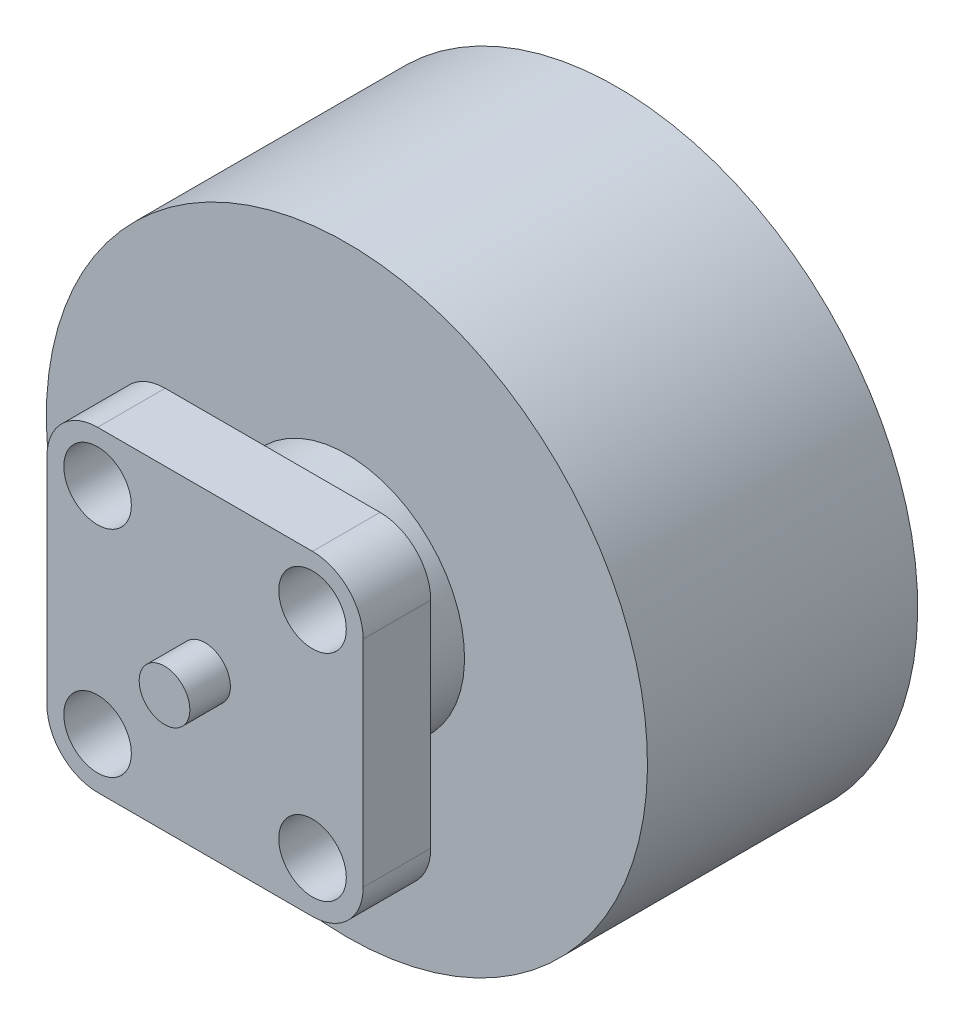
ISO-10303-21;
HEADER;
FILE_DESCRIPTION(('STEP AP214'),'2;1');
FILE_NAME('part.step','',(''),(''),'','','');
FILE_SCHEMA(('AUTOMOTIVE_DESIGN { 1 0 10303 214 1 1 1 1 }'));
ENDSEC;
DATA;
#1=APPLICATION_CONTEXT('core data for automotive mechanical design processes');
#2=APPLICATION_PROTOCOL_DEFINITION('international standard','automotive_design',2000,#1);
#3=PRODUCT_CONTEXT('',#1,'mechanical');
#4=PRODUCT('Part','Part','',(#3));
#5=PRODUCT_RELATED_PRODUCT_CATEGORY('part','',(#4));
#6=PRODUCT_DEFINITION_FORMATION('','',#4);
#7=PRODUCT_DEFINITION_CONTEXT('part definition',#1,'design');
#8=PRODUCT_DEFINITION('design','',#6,#7);
#9=PRODUCT_DEFINITION_SHAPE('','',#8);
#10=(LENGTH_UNIT() NAMED_UNIT(*) SI_UNIT(.MILLI.,.METRE.));
#11=(NAMED_UNIT(*) PLANE_ANGLE_UNIT() SI_UNIT($,.RADIAN.));
#12=(NAMED_UNIT(*) SI_UNIT($,.STERADIAN.) SOLID_ANGLE_UNIT());
#13=UNCERTAINTY_MEASURE_WITH_UNIT(LENGTH_MEASURE(1.E-05),#10,'distance_accuracy_value','');
#14=(GEOMETRIC_REPRESENTATION_CONTEXT(3) GLOBAL_UNCERTAINTY_ASSIGNED_CONTEXT((#13)) GLOBAL_UNIT_ASSIGNED_CONTEXT((#10,
#11,#12)) REPRESENTATION_CONTEXT('',''));
#15=CARTESIAN_POINT('',(0.,0.,0.));
#16=DIRECTION('',(0.,0.,1.));
#17=DIRECTION('',(1.,0.,0.));
#18=AXIS2_PLACEMENT_3D('',#15,#16,#17);
#19=CARTESIAN_POINT('',(0.,0.,-16.4));
#20=DIRECTION('',(0.,0.,-1.));
#21=DIRECTION('',(0.,1.,0.));
#22=AXIS2_PLACEMENT_3D('',#19,#20,#21);
#23=PLANE('',#22);
#24=CARTESIAN_POINT('',(0.,0.,-16.4));
#25=DIRECTION('',(0.,0.,1.));
#26=DIRECTION('',(0.,-1.,0.));
#27=AXIS2_PLACEMENT_3D('',#24,#25,#26);
#28=CIRCLE('',#27,0.75);
#29=CARTESIAN_POINT('',(0.,-0.75,-16.4));
#30=VERTEX_POINT('',#29);
#31=EDGE_CURVE('E145',#30,#30,#28,.T.);
#32=ORIENTED_EDGE('',*,*,#31,.F.);
#33=EDGE_LOOP('',(#32));
#34=FACE_BOUND('',#33,.T.);
#35=ADVANCED_FACE('F42',(#34),#23,.T.);
#36=CARTESIAN_POINT('',(0.,0.,1.2));
#37=DIRECTION('',(0.,0.,1.));
#38=DIRECTION('',(0.,-1.,0.));
#39=AXIS2_PLACEMENT_3D('',#36,#37,#38);
#40=CYLINDRICAL_SURFACE('',#39,0.75);
#41=ORIENTED_EDGE('',*,*,#31,.T.);
#42=EDGE_LOOP('',(#41));
#43=FACE_BOUND('',#42,.T.);
#44=CARTESIAN_POINT('',(0.,0.,-12.2));
#45=DIRECTION('',(0.,0.,1.));
#46=DIRECTION('',(0.,-1.,0.));
#47=AXIS2_PLACEMENT_3D('',#44,#45,#46);
#48=CIRCLE('',#47,0.75);
#49=CARTESIAN_POINT('',(0.,-0.75,-12.2));
#50=VERTEX_POINT('',#49);
#51=EDGE_CURVE('E224',#50,#50,#48,.T.);
#52=ORIENTED_EDGE('',*,*,#51,.F.);
#53=EDGE_LOOP('',(#52));
#54=FACE_BOUND('',#53,.T.);
#55=ADVANCED_FACE('F231',(#43,#54),#40,.T.);
#56=CARTESIAN_POINT('',(0.,0.,-12.2));
#57=DIRECTION('',(0.,0.,1.));
#58=DIRECTION('',(0.,-1.,0.));
#59=AXIS2_PLACEMENT_3D('',#56,#57,#58);
#60=PLANE('',#59);
#61=CARTESIAN_POINT('',(0.,2.5,-12.2));
#62=DIRECTION('',(0.,0.,-1.));
#63=DIRECTION('',(0.,1.,0.));
#64=AXIS2_PLACEMENT_3D('',#61,#62,#63);
#65=CIRCLE('',#64,1.);
#66=CARTESIAN_POINT('',(0.,3.5,-12.2));
#67=VERTEX_POINT('',#66);
#68=EDGE_CURVE('E325',#67,#67,#65,.T.);
#69=ORIENTED_EDGE('',*,*,#68,.F.);
#70=EDGE_LOOP('',(#69));
#71=FACE_BOUND('',#70,.T.);
#72=CARTESIAN_POINT('',(-2.5,0.,-12.2));
#73=DIRECTION('',(0.,0.,-1.));
#74=DIRECTION('',(0.,1.,0.));
#75=AXIS2_PLACEMENT_3D('',#72,#73,#74);
#76=CIRCLE('',#75,1.00000000000001);
#77=CARTESIAN_POINT('',(-2.5,1.00000000000001,-12.2));
#78=VERTEX_POINT('',#77);
#79=EDGE_CURVE('E321',#78,#78,#76,.T.);
#80=ORIENTED_EDGE('',*,*,#79,.F.);
#81=EDGE_LOOP('',(#80));
#82=FACE_BOUND('',#81,.T.);
#83=CARTESIAN_POINT('',(0.,-2.5,-12.2));
#84=DIRECTION('',(0.,0.,-1.));
#85=DIRECTION('',(0.,1.,0.));
#86=AXIS2_PLACEMENT_3D('',#83,#84,#85);
#87=CIRCLE('',#86,1.00000000000002);
#88=CARTESIAN_POINT('',(0.,-1.49999999999998,-12.2));
#89=VERTEX_POINT('',#88);
#90=EDGE_CURVE('E313',#89,#89,#87,.T.);
#91=ORIENTED_EDGE('',*,*,#90,.F.);
#92=EDGE_LOOP('',(#91));
#93=FACE_BOUND('',#92,.T.);
#94=CARTESIAN_POINT('',(2.5,0.,-12.2));
#95=DIRECTION('',(0.,0.,-1.));
#96=DIRECTION('',(0.,1.,0.));
#97=AXIS2_PLACEMENT_3D('',#94,#95,#96);
#98=CIRCLE('',#97,1.00000000000003);
#99=CARTESIAN_POINT('',(2.5,1.00000000000002,-12.2));
#100=VERTEX_POINT('',#99);
#101=EDGE_CURVE('E305',#100,#100,#98,.T.);
#102=ORIENTED_EDGE('',*,*,#101,.F.);
#103=EDGE_LOOP('',(#102));
#104=FACE_BOUND('',#103,.T.);
#105=CARTESIAN_POINT('',(0.,0.,-12.2));
#106=DIRECTION('',(0.,0.,1.));
#107=DIRECTION('',(0.,-1.,0.));
#108=AXIS2_PLACEMENT_3D('',#105,#106,#107);
#109=CIRCLE('',#108,8.9);
#110=CARTESIAN_POINT('',(0.,-8.9,-12.2));
#111=VERTEX_POINT('',#110);
#112=EDGE_CURVE('E220',#111,#111,#109,.T.);
#113=ORIENTED_EDGE('',*,*,#112,.F.);
#114=EDGE_LOOP('',(#113));
#115=FACE_BOUND('',#114,.T.);
#116=ORIENTED_EDGE('',*,*,#51,.T.);
#117=EDGE_LOOP('',(#116));
#118=FACE_BOUND('',#117,.T.);
#119=ADVANCED_FACE('F239',(#71,#82,#93,#104,#115,#118),#60,.F.);
#120=CARTESIAN_POINT('',(0.,0.,1.2));
#121=DIRECTION('',(0.,0.,1.));
#122=DIRECTION('',(0.,-1.,0.));
#123=AXIS2_PLACEMENT_3D('',#120,#121,#122);
#124=CYLINDRICAL_SURFACE('',#123,8.9);
#125=ORIENTED_EDGE('',*,*,#112,.T.);
#126=EDGE_LOOP('',(#125));
#127=FACE_BOUND('',#126,.T.);
#128=CARTESIAN_POINT('',(0.,0.,-4.2));
#129=DIRECTION('',(0.,0.,1.));
#130=DIRECTION('',(0.,-1.,0.));
#131=AXIS2_PLACEMENT_3D('',#128,#129,#130);
#132=CIRCLE('',#131,8.9);
#133=CARTESIAN_POINT('',(0.,-8.9,-4.2));
#134=VERTEX_POINT('',#133);
#135=EDGE_CURVE('E216',#134,#134,#132,.T.);
#136=ORIENTED_EDGE('',*,*,#135,.F.);
#137=EDGE_LOOP('',(#136));
#138=FACE_BOUND('',#137,.T.);
#139=ADVANCED_FACE('F344',(#127,#138),#124,.T.);
#140=CARTESIAN_POINT('',(0.,0.,-4.2));
#141=DIRECTION('',(0.,0.,1.));
#142=DIRECTION('',(0.,-1.,0.));
#143=AXIS2_PLACEMENT_3D('',#140,#141,#142);
#144=PLANE('',#143);
#145=ORIENTED_EDGE('',*,*,#135,.T.);
#146=EDGE_LOOP('',(#145));
#147=FACE_BOUND('',#146,.T.);
#148=CARTESIAN_POINT('',(0.,0.,-4.2));
#149=DIRECTION('',(0.,0.,1.));
#150=DIRECTION('',(0.,-1.,0.));
#151=AXIS2_PLACEMENT_3D('',#148,#149,#150);
#152=CIRCLE('',#151,3.48356344531644);
#153=CARTESIAN_POINT('',(0.,-3.48356344531644,-4.2));
#154=VERTEX_POINT('',#153);
#155=EDGE_CURVE('E212',#154,#154,#152,.T.);
#156=ORIENTED_EDGE('',*,*,#155,.F.);
#157=EDGE_LOOP('',(#156));
#158=FACE_BOUND('',#157,.T.);
#159=ADVANCED_FACE('F357',(#147,#158),#144,.T.);
#160=CARTESIAN_POINT('',(0.,0.,1.2));
#161=DIRECTION('',(0.,0.,1.));
#162=DIRECTION('',(0.,-1.,0.));
#163=AXIS2_PLACEMENT_3D('',#160,#161,#162);
#164=CYLINDRICAL_SURFACE('',#163,3.48356344531644);
#165=CARTESIAN_POINT('',(0.,0.,-2.));
#166=DIRECTION('',(0.,0.,-1.));
#167=DIRECTION('',(-1.,0.,0.));
#168=AXIS2_PLACEMENT_3D('',#165,#166,#167);
#169=CIRCLE('',#168,3.48356344531644);
#170=CARTESIAN_POINT('',(-3.48356344531644,0.,-2.));
#171=VERTEX_POINT('',#170);
#172=EDGE_CURVE('E138',#171,#171,#169,.F.);
#173=ORIENTED_EDGE('',*,*,#172,.F.);
#174=EDGE_LOOP('',(#173));
#175=FACE_BOUND('',#174,.T.);
#176=ORIENTED_EDGE('',*,*,#155,.T.);
#177=EDGE_LOOP('',(#176));
#178=FACE_BOUND('',#177,.T.);
#179=ADVANCED_FACE('F363',(#175,#178),#164,.T.);
#180=CARTESIAN_POINT('',(4.68198051533946,-4.68198051533946,-2.));
#181=DIRECTION('',(1.,0.,0.));
#182=DIRECTION('',(0.,0.,-1.));
#183=AXIS2_PLACEMENT_3D('',#180,#181,#182);
#184=PLANE('',#183);
#185=DIRECTION('',(0.,1.,0.));
#186=VECTOR('',#185,1.);
#187=CARTESIAN_POINT('',(4.68198051533946,-4.68198051533946,0.));
#188=LINE('',#187,#186);
#189=CARTESIAN_POINT('',(4.68198051533946,-3.18198051533946,0.));
#190=VERTEX_POINT('',#189);
#191=CARTESIAN_POINT('',(4.68198051533946,3.18198051533946,0.));
#192=VERTEX_POINT('',#191);
#193=EDGE_CURVE('E194',#190,#192,#188,.T.);
#194=ORIENTED_EDGE('',*,*,#193,.F.);
#195=DIRECTION('',(0.,0.,1.));
#196=VECTOR('',#195,1.);
#197=CARTESIAN_POINT('',(4.68198051533946,-3.18198051533946,-2.));
#198=LINE('',#197,#196);
#199=CARTESIAN_POINT('',(4.68198051533946,-3.18198051533946,-2.));
#200=VERTEX_POINT('',#199);
#201=EDGE_CURVE('E159',#190,#200,#198,.F.);
#202=ORIENTED_EDGE('',*,*,#201,.T.);
#203=DIRECTION('',(0.,1.,0.));
#204=VECTOR('',#203,1.);
#205=CARTESIAN_POINT('',(4.68198051533946,-4.68198051533946,-2.));
#206=LINE('',#205,#204);
#207=CARTESIAN_POINT('',(4.68198051533946,3.18198051533946,-2.));
#208=VERTEX_POINT('',#207);
#209=EDGE_CURVE('E132',#200,#208,#206,.T.);
#210=ORIENTED_EDGE('',*,*,#209,.T.);
#211=DIRECTION('',(0.,0.,1.));
#212=VECTOR('',#211,1.);
#213=CARTESIAN_POINT('',(4.68198051533946,3.18198051533946,-2.));
#214=LINE('',#213,#212);
#215=EDGE_CURVE('E155',#208,#192,#214,.T.);
#216=ORIENTED_EDGE('',*,*,#215,.T.);
#217=EDGE_LOOP('',(#194,#202,#210,#216));
#218=FACE_BOUND('',#217,.T.);
#219=ADVANCED_FACE('F263',(#218),#184,.T.);
#220=CARTESIAN_POINT('',(-4.68198051533946,-4.68198051533946,-2.));
#221=DIRECTION('',(0.,-1.,0.));
#222=DIRECTION('',(0.,0.,-1.));
#223=AXIS2_PLACEMENT_3D('',#220,#221,#222);
#224=PLANE('',#223);
#225=DIRECTION('',(1.,0.,0.));
#226=VECTOR('',#225,1.);
#227=CARTESIAN_POINT('',(-4.68198051533946,-4.68198051533946,-2.));
#228=LINE('',#227,#226);
#229=CARTESIAN_POINT('',(-3.18198051533946,-4.68198051533946,-2.));
#230=VERTEX_POINT('',#229);
#231=CARTESIAN_POINT('',(3.18198051533946,-4.68198051533946,-2.));
#232=VERTEX_POINT('',#231);
#233=EDGE_CURVE('E184',#230,#232,#228,.T.);
#234=ORIENTED_EDGE('',*,*,#233,.T.);
#235=DIRECTION('',(0.,0.,1.));
#236=VECTOR('',#235,1.);
#237=CARTESIAN_POINT('',(3.18198051533946,-4.68198051533946,-2.));
#238=LINE('',#237,#236);
#239=CARTESIAN_POINT('',(3.18198051533946,-4.68198051533946,0.));
#240=VERTEX_POINT('',#239);
#241=EDGE_CURVE('E130',#232,#240,#238,.T.);
#242=ORIENTED_EDGE('',*,*,#241,.T.);
#243=DIRECTION('',(1.,0.,0.));
#244=VECTOR('',#243,1.);
#245=CARTESIAN_POINT('',(-4.68198051533946,-4.68198051533946,0.));
#246=LINE('',#245,#244);
#247=CARTESIAN_POINT('',(-3.18198051533946,-4.68198051533946,0.));
#248=VERTEX_POINT('',#247);
#249=EDGE_CURVE('E112',#248,#240,#246,.T.);
#250=ORIENTED_EDGE('',*,*,#249,.F.);
#251=DIRECTION('',(0.,0.,1.));
#252=VECTOR('',#251,1.);
#253=CARTESIAN_POINT('',(-3.18198051533946,-4.68198051533946,-2.));
#254=LINE('',#253,#252);
#255=EDGE_CURVE('E127',#248,#230,#254,.F.);
#256=ORIENTED_EDGE('',*,*,#255,.T.);
#257=EDGE_LOOP('',(#234,#242,#250,#256));
#258=FACE_BOUND('',#257,.T.);
#259=ADVANCED_FACE('F126',(#258),#224,.T.);
#260=CARTESIAN_POINT('',(-4.68198051533946,-4.68198051533946,-2.));
#261=DIRECTION('',(-1.,0.,0.));
#262=DIRECTION('',(0.,0.,1.));
#263=AXIS2_PLACEMENT_3D('',#260,#261,#262);
#264=PLANE('',#263);
#265=DIRECTION('',(0.,-1.,0.));
#266=VECTOR('',#265,1.);
#267=CARTESIAN_POINT('',(-4.68198051533946,-4.68198051533946,-2.));
#268=LINE('',#267,#266);
#269=CARTESIAN_POINT('',(-4.68198051533946,3.18198051533946,-2.));
#270=VERTEX_POINT('',#269);
#271=CARTESIAN_POINT('',(-4.68198051533946,-3.18198051533946,-2.));
#272=VERTEX_POINT('',#271);
#273=EDGE_CURVE('E182',#270,#272,#268,.T.);
#274=ORIENTED_EDGE('',*,*,#273,.T.);
#275=DIRECTION('',(0.,0.,1.));
#276=VECTOR('',#275,1.);
#277=CARTESIAN_POINT('',(-4.68198051533946,-3.18198051533946,-2.));
#278=LINE('',#277,#276);
#279=CARTESIAN_POINT('',(-4.68198051533946,-3.18198051533946,0.));
#280=VERTEX_POINT('',#279);
#281=EDGE_CURVE('E175',#272,#280,#278,.T.);
#282=ORIENTED_EDGE('',*,*,#281,.T.);
#283=DIRECTION('',(0.,-1.,0.));
#284=VECTOR('',#283,1.);
#285=CARTESIAN_POINT('',(-4.68198051533946,-4.68198051533946,0.));
#286=LINE('',#285,#284);
#287=CARTESIAN_POINT('',(-4.68198051533946,3.18198051533946,0.));
#288=VERTEX_POINT('',#287);
#289=EDGE_CURVE('E114',#288,#280,#286,.T.);
#290=ORIENTED_EDGE('',*,*,#289,.F.);
#291=DIRECTION('',(0.,0.,1.));
#292=VECTOR('',#291,1.);
#293=CARTESIAN_POINT('',(-4.68198051533946,3.18198051533946,-2.));
#294=LINE('',#293,#292);
#295=EDGE_CURVE('E172',#288,#270,#294,.F.);
#296=ORIENTED_EDGE('',*,*,#295,.T.);
#297=EDGE_LOOP('',(#274,#282,#290,#296));
#298=FACE_BOUND('',#297,.T.);
#299=ADVANCED_FACE('F180',(#298),#264,.T.);
#300=CARTESIAN_POINT('',(-4.68198051533946,4.68198051533946,-2.));
#301=DIRECTION('',(0.,1.,0.));
#302=DIRECTION('',(0.,0.,1.));
#303=AXIS2_PLACEMENT_3D('',#300,#301,#302);
#304=PLANE('',#303);
#305=DIRECTION('',(-1.,0.,0.));
#306=VECTOR('',#305,1.);
#307=CARTESIAN_POINT('',(-4.68198051533946,4.68198051533946,-2.));
#308=LINE('',#307,#306);
#309=CARTESIAN_POINT('',(3.18198051533946,4.68198051533946,-2.));
#310=VERTEX_POINT('',#309);
#311=CARTESIAN_POINT('',(-3.18198051533946,4.68198051533946,-2.));
#312=VERTEX_POINT('',#311);
#313=EDGE_CURVE('E185',#310,#312,#308,.T.);
#314=ORIENTED_EDGE('',*,*,#313,.T.);
#315=DIRECTION('',(0.,0.,1.));
#316=VECTOR('',#315,1.);
#317=CARTESIAN_POINT('',(-3.18198051533946,4.68198051533946,-2.));
#318=LINE('',#317,#316);
#319=CARTESIAN_POINT('',(-3.18198051533946,4.68198051533946,0.));
#320=VERTEX_POINT('',#319);
#321=EDGE_CURVE('E11',#312,#320,#318,.T.);
#322=ORIENTED_EDGE('',*,*,#321,.T.);
#323=DIRECTION('',(-1.,0.,0.));
#324=VECTOR('',#323,1.);
#325=CARTESIAN_POINT('',(-4.68198051533946,4.68198051533946,0.));
#326=LINE('',#325,#324);
#327=CARTESIAN_POINT('',(3.18198051533946,4.68198051533946,0.));
#328=VERTEX_POINT('',#327);
#329=EDGE_CURVE('E198',#328,#320,#326,.T.);
#330=ORIENTED_EDGE('',*,*,#329,.F.);
#331=DIRECTION('',(0.,0.,1.));
#332=VECTOR('',#331,1.);
#333=CARTESIAN_POINT('',(3.18198051533946,4.68198051533946,-2.));
#334=LINE('',#333,#332);
#335=EDGE_CURVE('E51',#328,#310,#334,.F.);
#336=ORIENTED_EDGE('',*,*,#335,.T.);
#337=EDGE_LOOP('',(#314,#322,#330,#336));
#338=FACE_BOUND('',#337,.T.);
#339=ADVANCED_FACE('F257',(#338),#304,.T.);
#340=CARTESIAN_POINT('',(0.,0.,-2.));
#341=DIRECTION('',(0.,0.,-1.));
#342=DIRECTION('',(-1.,0.,0.));
#343=AXIS2_PLACEMENT_3D('',#340,#341,#342);
#344=PLANE('',#343);
#345=ORIENTED_EDGE('',*,*,#172,.T.);
#346=EDGE_LOOP('',(#345));
#347=FACE_BOUND('',#346,.T.);
#348=CARTESIAN_POINT('',(-3.18198051533946,3.18198051533946,-2.));
#349=DIRECTION('',(0.,0.,1.));
#350=DIRECTION('',(1.,0.,0.));
#351=AXIS2_PLACEMENT_3D('',#348,#349,#350);
#352=CIRCLE('',#351,1.);
#353=CARTESIAN_POINT('',(-2.18198051533946,3.18198051533946,-2.));
#354=VERTEX_POINT('',#353);
#355=EDGE_CURVE('E289',#354,#354,#352,.T.);
#356=ORIENTED_EDGE('',*,*,#355,.T.);
#357=EDGE_LOOP('',(#356));
#358=FACE_BOUND('',#357,.T.);
#359=CARTESIAN_POINT('',(-3.18198051533946,-3.18198051533946,-2.));
#360=DIRECTION('',(0.,0.,1.));
#361=DIRECTION('',(1.,0.,0.));
#362=AXIS2_PLACEMENT_3D('',#359,#360,#361);
#363=CIRCLE('',#362,1.);
#364=CARTESIAN_POINT('',(-2.18198051533946,-3.18198051533946,-2.));
#365=VERTEX_POINT('',#364);
#366=EDGE_CURVE('E281',#365,#365,#363,.T.);
#367=ORIENTED_EDGE('',*,*,#366,.T.);
#368=EDGE_LOOP('',(#367));
#369=FACE_BOUND('',#368,.T.);
#370=CARTESIAN_POINT('',(3.18198051533946,-3.18198051533946,-2.));
#371=DIRECTION('',(0.,0.,1.));
#372=DIRECTION('',(1.,0.,0.));
#373=AXIS2_PLACEMENT_3D('',#370,#371,#372);
#374=CIRCLE('',#373,1.);
#375=CARTESIAN_POINT('',(4.18198051533946,-3.18198051533946,-2.));
#376=VERTEX_POINT('',#375);
#377=EDGE_CURVE('E273',#376,#376,#374,.T.);
#378=ORIENTED_EDGE('',*,*,#377,.T.);
#379=EDGE_LOOP('',(#378));
#380=FACE_BOUND('',#379,.T.);
#381=CARTESIAN_POINT('',(3.18198051533946,3.18198051533946,-2.));
#382=DIRECTION('',(0.,0.,1.));
#383=DIRECTION('',(1.,0.,0.));
#384=AXIS2_PLACEMENT_3D('',#381,#382,#383);
#385=CIRCLE('',#384,0.999999999999998);
#386=CARTESIAN_POINT('',(4.18198051533946,3.18198051533946,-2.));
#387=VERTEX_POINT('',#386);
#388=EDGE_CURVE('E199',#387,#387,#385,.T.);
#389=ORIENTED_EDGE('',*,*,#388,.T.);
#390=EDGE_LOOP('',(#389));
#391=FACE_BOUND('',#390,.T.);
#392=ORIENTED_EDGE('',*,*,#209,.F.);
#393=CARTESIAN_POINT('',(3.18198051533946,-3.18198051533946,-2.));
#394=DIRECTION('',(0.,0.,-1.));
#395=DIRECTION('',(-1.,0.,0.));
#396=AXIS2_PLACEMENT_3D('',#393,#394,#395);
#397=CIRCLE('',#396,1.5);
#398=EDGE_CURVE('E169',#200,#232,#397,.T.);
#399=ORIENTED_EDGE('',*,*,#398,.T.);
#400=ORIENTED_EDGE('',*,*,#233,.F.);
#401=CARTESIAN_POINT('',(-3.18198051533946,-3.18198051533946,-2.));
#402=DIRECTION('',(0.,0.,-1.));
#403=DIRECTION('',(-1.,0.,0.));
#404=AXIS2_PLACEMENT_3D('',#401,#402,#403);
#405=CIRCLE('',#404,1.5);
#406=EDGE_CURVE('E136',#230,#272,#405,.T.);
#407=ORIENTED_EDGE('',*,*,#406,.T.);
#408=ORIENTED_EDGE('',*,*,#273,.F.);
#409=CARTESIAN_POINT('',(-3.18198051533946,3.18198051533946,-2.));
#410=DIRECTION('',(0.,0.,-1.));
#411=DIRECTION('',(-1.,0.,0.));
#412=AXIS2_PLACEMENT_3D('',#409,#410,#411);
#413=CIRCLE('',#412,1.5);
#414=EDGE_CURVE('E58',#270,#312,#413,.T.);
#415=ORIENTED_EDGE('',*,*,#414,.T.);
#416=ORIENTED_EDGE('',*,*,#313,.F.);
#417=CARTESIAN_POINT('',(3.18198051533946,3.18198051533946,-2.));
#418=DIRECTION('',(0.,0.,-1.));
#419=DIRECTION('',(-1.,0.,0.));
#420=AXIS2_PLACEMENT_3D('',#417,#418,#419);
#421=CIRCLE('',#420,1.5);
#422=EDGE_CURVE('E162',#310,#208,#421,.T.);
#423=ORIENTED_EDGE('',*,*,#422,.T.);
#424=EDGE_LOOP('',(#392,#399,#400,#407,#408,#415,#416,#423));
#425=FACE_BOUND('',#424,.T.);
#426=ADVANCED_FACE('F390',(#347,#358,#369,#380,#391,#425),#344,.T.);
#427=CARTESIAN_POINT('',(3.18198051533946,3.18198051533946,-2.));
#428=DIRECTION('',(0.,0.,1.));
#429=DIRECTION('',(1.,0.,0.));
#430=AXIS2_PLACEMENT_3D('',#427,#428,#429);
#431=CYLINDRICAL_SURFACE('',#430,0.999999999999998);
#432=ORIENTED_EDGE('',*,*,#388,.F.);
#433=EDGE_LOOP('',(#432));
#434=FACE_BOUND('',#433,.T.);
#435=CARTESIAN_POINT('',(3.18198051533946,3.18198051533946,0.));
#436=DIRECTION('',(0.,0.,1.));
#437=DIRECTION('',(1.,0.,0.));
#438=AXIS2_PLACEMENT_3D('',#435,#436,#437);
#439=CIRCLE('',#438,0.999999999999998);
#440=CARTESIAN_POINT('',(4.18198051533946,3.18198051533946,0.));
#441=VERTEX_POINT('',#440);
#442=EDGE_CURVE('E269',#441,#441,#439,.T.);
#443=ORIENTED_EDGE('',*,*,#442,.T.);
#444=EDGE_LOOP('',(#443));
#445=FACE_BOUND('',#444,.T.);
#446=ADVANCED_FACE('F397',(#434,#445),#431,.F.);
#447=CARTESIAN_POINT('',(3.18198051533946,-3.18198051533946,-2.));
#448=DIRECTION('',(0.,0.,1.));
#449=DIRECTION('',(1.,0.,0.));
#450=AXIS2_PLACEMENT_3D('',#447,#448,#449);
#451=CYLINDRICAL_SURFACE('',#450,1.);
#452=ORIENTED_EDGE('',*,*,#377,.F.);
#453=EDGE_LOOP('',(#452));
#454=FACE_BOUND('',#453,.T.);
#455=CARTESIAN_POINT('',(3.18198051533946,-3.18198051533946,0.));
#456=DIRECTION('',(0.,0.,1.));
#457=DIRECTION('',(1.,0.,0.));
#458=AXIS2_PLACEMENT_3D('',#455,#456,#457);
#459=CIRCLE('',#458,1.);
#460=CARTESIAN_POINT('',(4.18198051533946,-3.18198051533946,0.));
#461=VERTEX_POINT('',#460);
#462=EDGE_CURVE('E277',#461,#461,#459,.T.);
#463=ORIENTED_EDGE('',*,*,#462,.T.);
#464=EDGE_LOOP('',(#463));
#465=FACE_BOUND('',#464,.T.);
#466=ADVANCED_FACE('F401',(#454,#465),#451,.F.);
#467=CARTESIAN_POINT('',(-3.18198051533946,-3.18198051533946,-2.));
#468=DIRECTION('',(0.,0.,1.));
#469=DIRECTION('',(1.,0.,0.));
#470=AXIS2_PLACEMENT_3D('',#467,#468,#469);
#471=CYLINDRICAL_SURFACE('',#470,1.);
#472=ORIENTED_EDGE('',*,*,#366,.F.);
#473=EDGE_LOOP('',(#472));
#474=FACE_BOUND('',#473,.T.);
#475=CARTESIAN_POINT('',(-3.18198051533946,-3.18198051533946,0.));
#476=DIRECTION('',(0.,0.,1.));
#477=DIRECTION('',(1.,0.,0.));
#478=AXIS2_PLACEMENT_3D('',#475,#476,#477);
#479=CIRCLE('',#478,1.);
#480=CARTESIAN_POINT('',(-2.18198051533946,-3.18198051533946,0.));
#481=VERTEX_POINT('',#480);
#482=EDGE_CURVE('E285',#481,#481,#479,.T.);
#483=ORIENTED_EDGE('',*,*,#482,.T.);
#484=EDGE_LOOP('',(#483));
#485=FACE_BOUND('',#484,.T.);
#486=ADVANCED_FACE('F405',(#474,#485),#471,.F.);
#487=CARTESIAN_POINT('',(-3.18198051533946,3.18198051533946,-2.));
#488=DIRECTION('',(0.,0.,1.));
#489=DIRECTION('',(1.,0.,0.));
#490=AXIS2_PLACEMENT_3D('',#487,#488,#489);
#491=CYLINDRICAL_SURFACE('',#490,1.);
#492=ORIENTED_EDGE('',*,*,#355,.F.);
#493=EDGE_LOOP('',(#492));
#494=FACE_BOUND('',#493,.T.);
#495=CARTESIAN_POINT('',(-3.18198051533946,3.18198051533946,0.));
#496=DIRECTION('',(0.,0.,1.));
#497=DIRECTION('',(1.,0.,0.));
#498=AXIS2_PLACEMENT_3D('',#495,#496,#497);
#499=CIRCLE('',#498,1.);
#500=CARTESIAN_POINT('',(-2.18198051533946,3.18198051533946,0.));
#501=VERTEX_POINT('',#500);
#502=EDGE_CURVE('E293',#501,#501,#499,.T.);
#503=ORIENTED_EDGE('',*,*,#502,.T.);
#504=EDGE_LOOP('',(#503));
#505=FACE_BOUND('',#504,.T.);
#506=ADVANCED_FACE('F385',(#494,#505),#491,.F.);
#507=CARTESIAN_POINT('',(0.,0.,1.2));
#508=DIRECTION('',(0.,0.,-1.));
#509=DIRECTION('',(0.,1.,0.));
#510=AXIS2_PLACEMENT_3D('',#507,#508,#509);
#511=PLANE('',#510);
#512=CARTESIAN_POINT('',(0.,0.,1.2));
#513=DIRECTION('',(0.,0.,1.));
#514=DIRECTION('',(0.,-1.,0.));
#515=AXIS2_PLACEMENT_3D('',#512,#513,#514);
#516=CIRCLE('',#515,0.75);
#517=CARTESIAN_POINT('',(0.,-0.75,1.2));
#518=VERTEX_POINT('',#517);
#519=EDGE_CURVE('E189',#518,#518,#516,.T.);
#520=ORIENTED_EDGE('',*,*,#519,.T.);
#521=EDGE_LOOP('',(#520));
#522=FACE_BOUND('',#521,.T.);
#523=ADVANCED_FACE('F382',(#522),#511,.F.);
#524=CARTESIAN_POINT('',(0.,0.,1.2));
#525=DIRECTION('',(0.,0.,1.));
#526=DIRECTION('',(0.,-1.,0.));
#527=AXIS2_PLACEMENT_3D('',#524,#525,#526);
#528=CYLINDRICAL_SURFACE('',#527,0.75);
#529=CARTESIAN_POINT('',(0.,0.,0.));
#530=DIRECTION('',(0.,0.,1.));
#531=DIRECTION('',(0.,-1.,0.));
#532=AXIS2_PLACEMENT_3D('',#529,#530,#531);
#533=CIRCLE('',#532,0.75);
#534=CARTESIAN_POINT('',(0.,-0.75,0.));
#535=VERTEX_POINT('',#534);
#536=EDGE_CURVE('E208',#535,#535,#533,.T.);
#537=ORIENTED_EDGE('',*,*,#536,.T.);
#538=EDGE_LOOP('',(#537));
#539=FACE_BOUND('',#538,.T.);
#540=ORIENTED_EDGE('',*,*,#519,.F.);
#541=EDGE_LOOP('',(#540));
#542=FACE_BOUND('',#541,.T.);
#543=ADVANCED_FACE('F378',(#539,#542),#528,.T.);
#544=CARTESIAN_POINT('',(0.,0.,0.));
#545=DIRECTION('',(0.,0.,1.));
#546=DIRECTION('',(0.,-1.,0.));
#547=AXIS2_PLACEMENT_3D('',#544,#545,#546);
#548=PLANE('',#547);
#549=ORIENTED_EDGE('',*,*,#536,.F.);
#550=EDGE_LOOP('',(#549));
#551=FACE_BOUND('',#550,.T.);
#552=ORIENTED_EDGE('',*,*,#502,.F.);
#553=EDGE_LOOP('',(#552));
#554=FACE_BOUND('',#553,.T.);
#555=ORIENTED_EDGE('',*,*,#482,.F.);
#556=EDGE_LOOP('',(#555));
#557=FACE_BOUND('',#556,.T.);
#558=ORIENTED_EDGE('',*,*,#462,.F.);
#559=EDGE_LOOP('',(#558));
#560=FACE_BOUND('',#559,.T.);
#561=ORIENTED_EDGE('',*,*,#442,.F.);
#562=EDGE_LOOP('',(#561));
#563=FACE_BOUND('',#562,.T.);
#564=ORIENTED_EDGE('',*,*,#249,.T.);
#565=CARTESIAN_POINT('',(3.18198051533946,-3.18198051533946,0.));
#566=DIRECTION('',(0.,0.,1.));
#567=DIRECTION('',(0.,-1.,0.));
#568=AXIS2_PLACEMENT_3D('',#565,#566,#567);
#569=CIRCLE('',#568,1.5);
#570=EDGE_CURVE('E120',#240,#190,#569,.T.);
#571=ORIENTED_EDGE('',*,*,#570,.T.);
#572=ORIENTED_EDGE('',*,*,#193,.T.);
#573=CARTESIAN_POINT('',(3.18198051533946,3.18198051533946,0.));
#574=DIRECTION('',(0.,0.,1.));
#575=DIRECTION('',(0.,-1.,0.));
#576=AXIS2_PLACEMENT_3D('',#573,#574,#575);
#577=CIRCLE('',#576,1.5);
#578=EDGE_CURVE('E142',#192,#328,#577,.T.);
#579=ORIENTED_EDGE('',*,*,#578,.T.);
#580=ORIENTED_EDGE('',*,*,#329,.T.);
#581=CARTESIAN_POINT('',(-3.18198051533946,3.18198051533946,0.));
#582=DIRECTION('',(0.,0.,1.));
#583=DIRECTION('',(0.,-1.,0.));
#584=AXIS2_PLACEMENT_3D('',#581,#582,#583);
#585=CIRCLE('',#584,1.5);
#586=EDGE_CURVE('E121',#320,#288,#585,.T.);
#587=ORIENTED_EDGE('',*,*,#586,.T.);
#588=ORIENTED_EDGE('',*,*,#289,.T.);
#589=CARTESIAN_POINT('',(-3.18198051533946,-3.18198051533946,0.));
#590=DIRECTION('',(0.,0.,1.));
#591=DIRECTION('',(0.,-1.,0.));
#592=AXIS2_PLACEMENT_3D('',#589,#590,#591);
#593=CIRCLE('',#592,1.5);
#594=EDGE_CURVE('E109',#280,#248,#593,.T.);
#595=ORIENTED_EDGE('',*,*,#594,.T.);
#596=EDGE_LOOP('',(#564,#571,#572,#579,#580,#587,#588,#595));
#597=FACE_BOUND('',#596,.T.);
#598=ADVANCED_FACE('F111',(#551,#554,#557,#560,#563,#597),#548,.T.);
#599=CARTESIAN_POINT('',(3.18198051533946,-3.18198051533946,-2.));
#600=DIRECTION('',(0.,0.,1.));
#601=DIRECTION('',(1.,0.,0.));
#602=AXIS2_PLACEMENT_3D('',#599,#600,#601);
#603=CYLINDRICAL_SURFACE('',#602,1.5);
#604=ORIENTED_EDGE('',*,*,#398,.F.);
#605=ORIENTED_EDGE('',*,*,#201,.F.);
#606=ORIENTED_EDGE('',*,*,#570,.F.);
#607=ORIENTED_EDGE('',*,*,#241,.F.);
#608=EDGE_LOOP('',(#604,#605,#606,#607));
#609=FACE_BOUND('',#608,.T.);
#610=ADVANCED_FACE('F243',(#609),#603,.T.);
#611=CARTESIAN_POINT('',(-3.18198051533946,-3.18198051533946,-2.));
#612=DIRECTION('',(0.,0.,1.));
#613=DIRECTION('',(1.,0.,0.));
#614=AXIS2_PLACEMENT_3D('',#611,#612,#613);
#615=CYLINDRICAL_SURFACE('',#614,1.5);
#616=ORIENTED_EDGE('',*,*,#406,.F.);
#617=ORIENTED_EDGE('',*,*,#255,.F.);
#618=ORIENTED_EDGE('',*,*,#594,.F.);
#619=ORIENTED_EDGE('',*,*,#281,.F.);
#620=EDGE_LOOP('',(#616,#617,#618,#619));
#621=FACE_BOUND('',#620,.T.);
#622=ADVANCED_FACE('F135',(#621),#615,.T.);
#623=CARTESIAN_POINT('',(-3.18198051533946,3.18198051533946,-2.));
#624=DIRECTION('',(0.,0.,1.));
#625=DIRECTION('',(1.,0.,0.));
#626=AXIS2_PLACEMENT_3D('',#623,#624,#625);
#627=CYLINDRICAL_SURFACE('',#626,1.5);
#628=ORIENTED_EDGE('',*,*,#414,.F.);
#629=ORIENTED_EDGE('',*,*,#295,.F.);
#630=ORIENTED_EDGE('',*,*,#586,.F.);
#631=ORIENTED_EDGE('',*,*,#321,.F.);
#632=EDGE_LOOP('',(#628,#629,#630,#631));
#633=FACE_BOUND('',#632,.T.);
#634=ADVANCED_FACE('F248',(#633),#627,.T.);
#635=CARTESIAN_POINT('',(3.18198051533946,3.18198051533946,-2.));
#636=DIRECTION('',(0.,0.,1.));
#637=DIRECTION('',(1.,0.,0.));
#638=AXIS2_PLACEMENT_3D('',#635,#636,#637);
#639=CYLINDRICAL_SURFACE('',#638,1.5);
#640=ORIENTED_EDGE('',*,*,#422,.F.);
#641=ORIENTED_EDGE('',*,*,#335,.F.);
#642=ORIENTED_EDGE('',*,*,#578,.F.);
#643=ORIENTED_EDGE('',*,*,#215,.F.);
#644=EDGE_LOOP('',(#640,#641,#642,#643));
#645=FACE_BOUND('',#644,.T.);
#646=ADVANCED_FACE('F44',(#645),#639,.T.);
#647=CARTESIAN_POINT('',(2.5,0.,-10.2));
#648=DIRECTION('',(0.,0.,-1.));
#649=DIRECTION('',(0.,1.,0.));
#650=AXIS2_PLACEMENT_3D('',#647,#648,#649);
#651=CYLINDRICAL_SURFACE('',#650,1.00000000000003);
#652=CARTESIAN_POINT('',(2.5,0.,-10.2));
#653=DIRECTION('',(0.,0.,-1.));
#654=DIRECTION('',(0.,1.,0.));
#655=AXIS2_PLACEMENT_3D('',#652,#653,#654);
#656=CIRCLE('',#655,1.00000000000003);
#657=CARTESIAN_POINT('',(2.5,1.00000000000002,-10.2));
#658=VERTEX_POINT('',#657);
#659=EDGE_CURVE('E301',#658,#658,#656,.T.);
#660=ORIENTED_EDGE('',*,*,#659,.F.);
#661=EDGE_LOOP('',(#660));
#662=FACE_BOUND('',#661,.T.);
#663=ORIENTED_EDGE('',*,*,#101,.T.);
#664=EDGE_LOOP('',(#663));
#665=FACE_BOUND('',#664,.T.);
#666=ADVANCED_FACE('F254',(#662,#665),#651,.F.);
#667=CARTESIAN_POINT('',(2.5,0.,-10.2));
#668=DIRECTION('',(0.,0.,-1.));
#669=DIRECTION('',(0.,1.,0.));
#670=AXIS2_PLACEMENT_3D('',#667,#668,#669);
#671=PLANE('',#670);
#672=ORIENTED_EDGE('',*,*,#659,.T.);
#673=EDGE_LOOP('',(#672));
#674=FACE_BOUND('',#673,.T.);
#675=ADVANCED_FACE('F413',(#674),#671,.T.);
#676=CARTESIAN_POINT('',(0.,-2.5,-10.2));
#677=DIRECTION('',(0.,0.,-1.));
#678=DIRECTION('',(0.,1.,0.));
#679=AXIS2_PLACEMENT_3D('',#676,#677,#678);
#680=CYLINDRICAL_SURFACE('',#679,1.00000000000002);
#681=CARTESIAN_POINT('',(0.,-2.5,-10.2));
#682=DIRECTION('',(0.,0.,-1.));
#683=DIRECTION('',(0.,1.,0.));
#684=AXIS2_PLACEMENT_3D('',#681,#682,#683);
#685=CIRCLE('',#684,1.00000000000002);
#686=CARTESIAN_POINT('',(0.,-1.49999999999998,-10.2));
#687=VERTEX_POINT('',#686);
#688=EDGE_CURVE('E309',#687,#687,#685,.T.);
#689=ORIENTED_EDGE('',*,*,#688,.F.);
#690=EDGE_LOOP('',(#689));
#691=FACE_BOUND('',#690,.T.);
#692=ORIENTED_EDGE('',*,*,#90,.T.);
#693=EDGE_LOOP('',(#692));
#694=FACE_BOUND('',#693,.T.);
#695=ADVANCED_FACE('F416',(#691,#694),#680,.F.);
#696=CARTESIAN_POINT('',(0.,-2.5,-10.2));
#697=DIRECTION('',(0.,0.,-1.));
#698=DIRECTION('',(0.,1.,0.));
#699=AXIS2_PLACEMENT_3D('',#696,#697,#698);
#700=PLANE('',#699);
#701=ORIENTED_EDGE('',*,*,#688,.T.);
#702=EDGE_LOOP('',(#701));
#703=FACE_BOUND('',#702,.T.);
#704=ADVANCED_FACE('F421',(#703),#700,.T.);
#705=CARTESIAN_POINT('',(-2.5,0.,-10.2));
#706=DIRECTION('',(0.,0.,-1.));
#707=DIRECTION('',(0.,1.,0.));
#708=AXIS2_PLACEMENT_3D('',#705,#706,#707);
#709=CYLINDRICAL_SURFACE('',#708,1.00000000000001);
#710=CARTESIAN_POINT('',(-2.5,0.,-10.2));
#711=DIRECTION('',(0.,0.,-1.));
#712=DIRECTION('',(0.,1.,0.));
#713=AXIS2_PLACEMENT_3D('',#710,#711,#712);
#714=CIRCLE('',#713,1.00000000000001);
#715=CARTESIAN_POINT('',(-2.5,1.00000000000001,-10.2));
#716=VERTEX_POINT('',#715);
#717=EDGE_CURVE('E317',#716,#716,#714,.T.);
#718=ORIENTED_EDGE('',*,*,#717,.F.);
#719=EDGE_LOOP('',(#718));
#720=FACE_BOUND('',#719,.T.);
#721=ORIENTED_EDGE('',*,*,#79,.T.);
#722=EDGE_LOOP('',(#721));
#723=FACE_BOUND('',#722,.T.);
#724=ADVANCED_FACE('F424',(#720,#723),#709,.F.);
#725=CARTESIAN_POINT('',(-2.5,0.,-10.2));
#726=DIRECTION('',(0.,0.,-1.));
#727=DIRECTION('',(0.,1.,0.));
#728=AXIS2_PLACEMENT_3D('',#725,#726,#727);
#729=PLANE('',#728);
#730=ORIENTED_EDGE('',*,*,#717,.T.);
#731=EDGE_LOOP('',(#730));
#732=FACE_BOUND('',#731,.T.);
#733=ADVANCED_FACE('F338',(#732),#729,.T.);
#734=CARTESIAN_POINT('',(0.,2.5,-10.2));
#735=DIRECTION('',(0.,0.,-1.));
#736=DIRECTION('',(0.,1.,0.));
#737=AXIS2_PLACEMENT_3D('',#734,#735,#736);
#738=CYLINDRICAL_SURFACE('',#737,1.);
#739=CARTESIAN_POINT('',(0.,2.5,-10.2));
#740=DIRECTION('',(0.,0.,-1.));
#741=DIRECTION('',(0.,1.,0.));
#742=AXIS2_PLACEMENT_3D('',#739,#740,#741);
#743=CIRCLE('',#742,1.);
#744=CARTESIAN_POINT('',(0.,3.5,-10.2));
#745=VERTEX_POINT('',#744);
#746=EDGE_CURVE('E297',#745,#745,#743,.T.);
#747=ORIENTED_EDGE('',*,*,#746,.F.);
#748=EDGE_LOOP('',(#747));
#749=FACE_BOUND('',#748,.T.);
#750=ORIENTED_EDGE('',*,*,#68,.T.);
#751=EDGE_LOOP('',(#750));
#752=FACE_BOUND('',#751,.T.);
#753=ADVANCED_FACE('F335',(#749,#752),#738,.F.);
#754=CARTESIAN_POINT('',(0.,2.5,-10.2));
#755=DIRECTION('',(0.,0.,-1.));
#756=DIRECTION('',(0.,1.,0.));
#757=AXIS2_PLACEMENT_3D('',#754,#755,#756);
#758=PLANE('',#757);
#759=ORIENTED_EDGE('',*,*,#746,.T.);
#760=EDGE_LOOP('',(#759));
#761=FACE_BOUND('',#760,.T.);
#762=ADVANCED_FACE('F333',(#761),#758,.T.);
#763=CLOSED_SHELL('',(#35,#55,#119,#139,#159,#179,#219,#259,#299,#339,#426,#446,#466,#486,#506,
#523,#543,#598,#610,#622,#634,#646,#666,#675,#695,#704,#724,#733,#753,#762));
#764=MANIFOLD_SOLID_BREP('B2',#763);
#765=ADVANCED_BREP_SHAPE_REPRESENTATION('',(#18,#764),#14);
#766=SHAPE_DEFINITION_REPRESENTATION(#9,#765);
ENDSEC;
END-ISO-10303-21;
